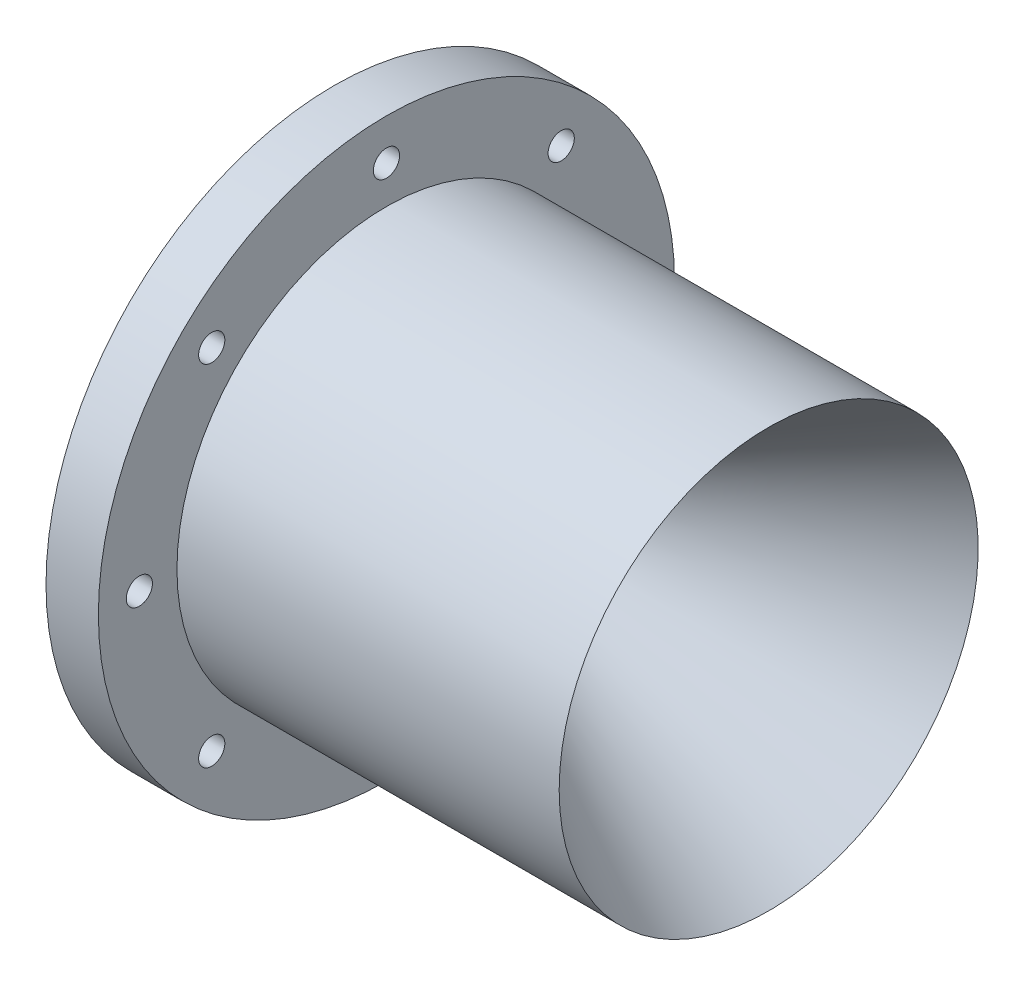
ISO-10303-21;
HEADER;
FILE_DESCRIPTION(('STEP AP214'),'2;1');
FILE_NAME('part.step','',(''),(''),'','','');
FILE_SCHEMA(('AUTOMOTIVE_DESIGN { 1 0 10303 214 1 1 1 1 }'));
ENDSEC;
DATA;
#1=APPLICATION_CONTEXT('core data for automotive mechanical design processes');
#2=APPLICATION_PROTOCOL_DEFINITION('international standard','automotive_design',2000,#1);
#3=PRODUCT_CONTEXT('',#1,'mechanical');
#4=PRODUCT('Part','Part','',(#3));
#5=PRODUCT_RELATED_PRODUCT_CATEGORY('part','',(#4));
#6=PRODUCT_DEFINITION_FORMATION('','',#4);
#7=PRODUCT_DEFINITION_CONTEXT('part definition',#1,'design');
#8=PRODUCT_DEFINITION('design','',#6,#7);
#9=PRODUCT_DEFINITION_SHAPE('','',#8);
#10=(LENGTH_UNIT() NAMED_UNIT(*) SI_UNIT(.MILLI.,.METRE.));
#11=(NAMED_UNIT(*) PLANE_ANGLE_UNIT() SI_UNIT($,.RADIAN.));
#12=(NAMED_UNIT(*) SI_UNIT($,.STERADIAN.) SOLID_ANGLE_UNIT());
#13=UNCERTAINTY_MEASURE_WITH_UNIT(LENGTH_MEASURE(1.E-05),#10,'distance_accuracy_value','');
#14=(GEOMETRIC_REPRESENTATION_CONTEXT(3) GLOBAL_UNCERTAINTY_ASSIGNED_CONTEXT((#13)) GLOBAL_UNIT_ASSIGNED_CONTEXT((#10,
#11,#12)) REPRESENTATION_CONTEXT('',''));
#15=CARTESIAN_POINT('',(0.,0.,0.));
#16=DIRECTION('',(0.,0.,1.));
#17=DIRECTION('',(1.,0.,0.));
#18=AXIS2_PLACEMENT_3D('',#15,#16,#17);
#19=CARTESIAN_POINT('',(0.,0.,0.));
#20=DIRECTION('',(-1.,0.,0.));
#21=DIRECTION('',(0.,0.,1.));
#22=AXIS2_PLACEMENT_3D('',#19,#20,#21);
#23=CYLINDRICAL_SURFACE('',#22,7.9375);
#24=CARTESIAN_POINT('',(0.,0.,0.));
#25=DIRECTION('',(-1.,0.,0.));
#26=DIRECTION('',(0.,0.,1.));
#27=AXIS2_PLACEMENT_3D('',#24,#25,#26);
#28=CIRCLE('',#27,7.9375);
#29=CARTESIAN_POINT('',(0.,0.,7.9375));
#30=VERTEX_POINT('',#29);
#31=EDGE_CURVE('E10',#30,#30,#28,.T.);
#32=ORIENTED_EDGE('',*,*,#31,.F.);
#33=EDGE_LOOP('',(#32));
#34=FACE_BOUND('',#33,.T.);
#35=CARTESIAN_POINT('',(-12.7,0.,0.));
#36=DIRECTION('',(-1.,0.,0.));
#37=DIRECTION('',(0.,0.,1.));
#38=AXIS2_PLACEMENT_3D('',#35,#36,#37);
#39=CIRCLE('',#38,7.9375);
#40=CARTESIAN_POINT('',(-12.7,0.,7.9375));
#41=VERTEX_POINT('',#40);
#42=EDGE_CURVE('E58',#41,#41,#39,.T.);
#43=ORIENTED_EDGE('',*,*,#42,.T.);
#44=EDGE_LOOP('',(#43));
#45=FACE_BOUND('',#44,.T.);
#46=ADVANCED_FACE('F33',(#34,#45),#23,.F.);
#47=CARTESIAN_POINT('',(0.,0.,0.));
#48=DIRECTION('',(1.,0.,0.));
#49=DIRECTION('',(0.,0.,-1.));
#50=AXIS2_PLACEMENT_3D('',#47,#48,#49);
#51=CONICAL_SURFACE('',#50,7.9375,0.534993353531431);
#52=CARTESIAN_POINT('',(72.3241560558228,0.,0.));
#53=DIRECTION('',(-1.,0.,0.));
#54=DIRECTION('',(0.,0.,1.));
#55=AXIS2_PLACEMENT_3D('',#52,#53,#54);
#56=CIRCLE('',#55,50.8);
#57=CARTESIAN_POINT('',(72.3241560558228,0.,50.8));
#58=VERTEX_POINT('',#57);
#59=EDGE_CURVE('E39',#58,#58,#56,.T.);
#60=ORIENTED_EDGE('',*,*,#59,.F.);
#61=EDGE_LOOP('',(#60));
#62=FACE_BOUND('',#61,.T.);
#63=ORIENTED_EDGE('',*,*,#31,.T.);
#64=EDGE_LOOP('',(#63));
#65=FACE_BOUND('',#64,.T.);
#66=ADVANCED_FACE('F151',(#62,#65),#51,.F.);
#67=CARTESIAN_POINT('',(0.,0.,0.));
#68=DIRECTION('',(-1.,0.,0.));
#69=DIRECTION('',(0.,0.,1.));
#70=AXIS2_PLACEMENT_3D('',#67,#68,#69);
#71=CYLINDRICAL_SURFACE('',#70,50.8);
#72=CARTESIAN_POINT('',(-20.3472668619156,0.,0.));
#73=DIRECTION('',(-1.,0.,0.));
#74=DIRECTION('',(0.,0.,1.));
#75=AXIS2_PLACEMENT_3D('',#72,#73,#74);
#76=CIRCLE('',#75,50.8);
#77=CARTESIAN_POINT('',(-20.3472668619156,0.,50.8));
#78=VERTEX_POINT('',#77);
#79=EDGE_CURVE('E43',#78,#78,#76,.T.);
#80=ORIENTED_EDGE('',*,*,#79,.F.);
#81=EDGE_LOOP('',(#80));
#82=FACE_BOUND('',#81,.T.);
#83=ORIENTED_EDGE('',*,*,#59,.T.);
#84=EDGE_LOOP('',(#83));
#85=FACE_BOUND('',#84,.T.);
#86=ADVANCED_FACE('F145',(#82,#85),#71,.T.);
#87=CARTESIAN_POINT('',(-20.3472668619156,69.85,0.));
#88=DIRECTION('',(-1.,0.,0.));
#89=DIRECTION('',(0.,0.,1.));
#90=AXIS2_PLACEMENT_3D('',#87,#88,#89);
#91=PLANE('',#90);
#92=CARTESIAN_POINT('',(-20.3472668619156,59.9186,0.));
#93=DIRECTION('',(-1.,0.,0.));
#94=DIRECTION('',(0.,0.,1.));
#95=AXIS2_PLACEMENT_3D('',#92,#93,#94);
#96=CIRCLE('',#95,3.175);
#97=CARTESIAN_POINT('',(-20.3472668619156,59.9186,3.175));
#98=VERTEX_POINT('',#97);
#99=EDGE_CURVE('E61',#98,#98,#96,.F.);
#100=ORIENTED_EDGE('',*,*,#99,.F.);
#101=EDGE_LOOP('',(#100));
#102=FACE_BOUND('',#101,.T.);
#103=CARTESIAN_POINT('',(-20.3472668619156,42.3688483792054,42.3688483792047));
#104=DIRECTION('',(-1.,0.,0.));
#105=DIRECTION('',(0.,0.,1.));
#106=AXIS2_PLACEMENT_3D('',#103,#104,#105);
#107=CIRCLE('',#106,3.17500000000024);
#108=CARTESIAN_POINT('',(-20.3472668619156,42.3688483792054,45.543848379205));
#109=VERTEX_POINT('',#108);
#110=EDGE_CURVE('E99',#109,#109,#107,.F.);
#111=ORIENTED_EDGE('',*,*,#110,.F.);
#112=EDGE_LOOP('',(#111));
#113=FACE_BOUND('',#112,.T.);
#114=CARTESIAN_POINT('',(-20.3472668619156,1.61747136534687E-12,59.9186000000016));
#115=DIRECTION('',(-1.,0.,0.));
#116=DIRECTION('',(0.,0.,1.));
#117=AXIS2_PLACEMENT_3D('',#114,#115,#116);
#118=CIRCLE('',#117,3.175);
#119=CARTESIAN_POINT('',(-20.3472668619156,1.61747136534687E-12,63.0936000000016));
#120=VERTEX_POINT('',#119);
#121=EDGE_CURVE('E93',#120,#120,#118,.F.);
#122=ORIENTED_EDGE('',*,*,#121,.F.);
#123=EDGE_LOOP('',(#122));
#124=FACE_BOUND('',#123,.T.);
#125=CARTESIAN_POINT('',(-20.3472668619156,-42.3688483792031,42.368848379207));
#126=DIRECTION('',(-1.,0.,0.));
#127=DIRECTION('',(0.,0.,1.));
#128=AXIS2_PLACEMENT_3D('',#125,#126,#127);
#129=CIRCLE('',#128,3.175);
#130=CARTESIAN_POINT('',(-20.3472668619156,-42.3688483792031,45.543848379207));
#131=VERTEX_POINT('',#130);
#132=EDGE_CURVE('E87',#131,#131,#129,.F.);
#133=ORIENTED_EDGE('',*,*,#132,.F.);
#134=EDGE_LOOP('',(#133));
#135=FACE_BOUND('',#134,.T.);
#136=CARTESIAN_POINT('',(-20.3472668619156,-59.9186,3.23494273069374E-12));
#137=DIRECTION('',(-1.,0.,0.));
#138=DIRECTION('',(0.,0.,1.));
#139=AXIS2_PLACEMENT_3D('',#136,#137,#138);
#140=CIRCLE('',#139,3.175);
#141=CARTESIAN_POINT('',(-20.3472668619156,-59.9186,3.17500000000323));
#142=VERTEX_POINT('',#141);
#143=EDGE_CURVE('E81',#142,#142,#140,.F.);
#144=ORIENTED_EDGE('',*,*,#143,.F.);
#145=EDGE_LOOP('',(#144));
#146=FACE_BOUND('',#145,.T.);
#147=CARTESIAN_POINT('',(-20.3472668619156,-42.3688483792054,-42.3688483792015));
#148=DIRECTION('',(-1.,0.,0.));
#149=DIRECTION('',(0.,0.,1.));
#150=AXIS2_PLACEMENT_3D('',#147,#148,#149);
#151=CIRCLE('',#150,3.175);
#152=CARTESIAN_POINT('',(-20.3472668619156,-42.3688483792054,-39.1938483792015));
#153=VERTEX_POINT('',#152);
#154=EDGE_CURVE('E75',#153,#153,#151,.F.);
#155=ORIENTED_EDGE('',*,*,#154,.F.);
#156=EDGE_LOOP('',(#155));
#157=FACE_BOUND('',#156,.T.);
#158=CARTESIAN_POINT('',(-20.3472668619156,-1.62480927751681E-12,-59.9185999999984));
#159=DIRECTION('',(-1.,0.,0.));
#160=DIRECTION('',(0.,0.,1.));
#161=AXIS2_PLACEMENT_3D('',#158,#159,#160);
#162=CIRCLE('',#161,3.175);
#163=CARTESIAN_POINT('',(-20.3472668619156,-1.62480927751681E-12,-56.7435999999984));
#164=VERTEX_POINT('',#163);
#165=EDGE_CURVE('E69',#164,#164,#162,.F.);
#166=ORIENTED_EDGE('',*,*,#165,.F.);
#167=EDGE_LOOP('',(#166));
#168=FACE_BOUND('',#167,.T.);
#169=CARTESIAN_POINT('',(-20.3472668619156,42.3688483792031,-42.3688483792038));
#170=DIRECTION('',(-1.,0.,0.));
#171=DIRECTION('',(0.,0.,1.));
#172=AXIS2_PLACEMENT_3D('',#169,#170,#171);
#173=CIRCLE('',#172,3.175);
#174=CARTESIAN_POINT('',(-20.3472668619156,42.3688483792031,-39.1938483792038));
#175=VERTEX_POINT('',#174);
#176=EDGE_CURVE('E62',#175,#175,#173,.F.);
#177=ORIENTED_EDGE('',*,*,#176,.F.);
#178=EDGE_LOOP('',(#177));
#179=FACE_BOUND('',#178,.T.);
#180=CARTESIAN_POINT('',(-20.3472668619156,0.,0.));
#181=DIRECTION('',(-1.,0.,0.));
#182=DIRECTION('',(0.,0.,1.));
#183=AXIS2_PLACEMENT_3D('',#180,#181,#182);
#184=CIRCLE('',#183,69.85);
#185=CARTESIAN_POINT('',(-20.3472668619156,0.,69.85));
#186=VERTEX_POINT('',#185);
#187=EDGE_CURVE('E47',#186,#186,#184,.T.);
#188=ORIENTED_EDGE('',*,*,#187,.F.);
#189=EDGE_LOOP('',(#188));
#190=FACE_BOUND('',#189,.T.);
#191=ORIENTED_EDGE('',*,*,#79,.T.);
#192=EDGE_LOOP('',(#191));
#193=FACE_BOUND('',#192,.T.);
#194=ADVANCED_FACE('F139',(#102,#113,#124,#135,#146,#157,#168,#179,#190,#193),#91,.F.);
#195=CARTESIAN_POINT('',(0.,0.,0.));
#196=DIRECTION('',(-1.,0.,0.));
#197=DIRECTION('',(0.,0.,1.));
#198=AXIS2_PLACEMENT_3D('',#195,#196,#197);
#199=CYLINDRICAL_SURFACE('',#198,69.85);
#200=CARTESIAN_POINT('',(-33.0472668619156,0.,0.));
#201=DIRECTION('',(-1.,0.,0.));
#202=DIRECTION('',(0.,0.,1.));
#203=AXIS2_PLACEMENT_3D('',#200,#201,#202);
#204=CIRCLE('',#203,69.85);
#205=CARTESIAN_POINT('',(-33.0472668619156,0.,69.85));
#206=VERTEX_POINT('',#205);
#207=EDGE_CURVE('E52',#206,#206,#204,.T.);
#208=ORIENTED_EDGE('',*,*,#207,.F.);
#209=EDGE_LOOP('',(#208));
#210=FACE_BOUND('',#209,.T.);
#211=ORIENTED_EDGE('',*,*,#187,.T.);
#212=EDGE_LOOP('',(#211));
#213=FACE_BOUND('',#212,.T.);
#214=ADVANCED_FACE('F117',(#210,#213),#199,.T.);
#215=CARTESIAN_POINT('',(-33.0472668619156,50.8,0.));
#216=DIRECTION('',(1.,0.,0.));
#217=DIRECTION('',(0.,0.,-1.));
#218=AXIS2_PLACEMENT_3D('',#215,#216,#217);
#219=PLANE('',#218);
#220=CARTESIAN_POINT('',(-33.0472668619156,59.9186,0.));
#221=DIRECTION('',(-1.,0.,0.));
#222=DIRECTION('',(0.,0.,1.));
#223=AXIS2_PLACEMENT_3D('',#220,#221,#222);
#224=CIRCLE('',#223,3.175);
#225=CARTESIAN_POINT('',(-33.0472668619156,59.9186,3.175));
#226=VERTEX_POINT('',#225);
#227=EDGE_CURVE('E102',#226,#226,#224,.T.);
#228=ORIENTED_EDGE('',*,*,#227,.F.);
#229=EDGE_LOOP('',(#228));
#230=FACE_BOUND('',#229,.T.);
#231=CARTESIAN_POINT('',(-33.0472668619156,42.3688483792054,42.3688483792047));
#232=DIRECTION('',(-1.,0.,0.));
#233=DIRECTION('',(0.,0.,1.));
#234=AXIS2_PLACEMENT_3D('',#231,#232,#233);
#235=CIRCLE('',#234,3.17500000000024);
#236=CARTESIAN_POINT('',(-33.0472668619156,42.3688483792054,45.543848379205));
#237=VERTEX_POINT('',#236);
#238=EDGE_CURVE('E96',#237,#237,#235,.T.);
#239=ORIENTED_EDGE('',*,*,#238,.F.);
#240=EDGE_LOOP('',(#239));
#241=FACE_BOUND('',#240,.T.);
#242=CARTESIAN_POINT('',(-33.0472668619156,1.61747136534687E-12,59.9186000000016));
#243=DIRECTION('',(-1.,0.,0.));
#244=DIRECTION('',(0.,0.,1.));
#245=AXIS2_PLACEMENT_3D('',#242,#243,#244);
#246=CIRCLE('',#245,3.175);
#247=CARTESIAN_POINT('',(-33.0472668619156,1.61747136534687E-12,63.0936000000016));
#248=VERTEX_POINT('',#247);
#249=EDGE_CURVE('E90',#248,#248,#246,.T.);
#250=ORIENTED_EDGE('',*,*,#249,.F.);
#251=EDGE_LOOP('',(#250));
#252=FACE_BOUND('',#251,.T.);
#253=CARTESIAN_POINT('',(-33.0472668619156,-42.3688483792031,42.368848379207));
#254=DIRECTION('',(-1.,0.,0.));
#255=DIRECTION('',(0.,0.,1.));
#256=AXIS2_PLACEMENT_3D('',#253,#254,#255);
#257=CIRCLE('',#256,3.175);
#258=CARTESIAN_POINT('',(-33.0472668619156,-42.3688483792031,45.543848379207));
#259=VERTEX_POINT('',#258);
#260=EDGE_CURVE('E84',#259,#259,#257,.T.);
#261=ORIENTED_EDGE('',*,*,#260,.F.);
#262=EDGE_LOOP('',(#261));
#263=FACE_BOUND('',#262,.T.);
#264=CARTESIAN_POINT('',(-33.0472668619156,-59.9186,3.23494273069374E-12));
#265=DIRECTION('',(-1.,0.,0.));
#266=DIRECTION('',(0.,0.,1.));
#267=AXIS2_PLACEMENT_3D('',#264,#265,#266);
#268=CIRCLE('',#267,3.175);
#269=CARTESIAN_POINT('',(-33.0472668619156,-59.9186,3.17500000000323));
#270=VERTEX_POINT('',#269);
#271=EDGE_CURVE('E78',#270,#270,#268,.T.);
#272=ORIENTED_EDGE('',*,*,#271,.F.);
#273=EDGE_LOOP('',(#272));
#274=FACE_BOUND('',#273,.T.);
#275=CARTESIAN_POINT('',(-33.0472668619156,-42.3688483792054,-42.3688483792015));
#276=DIRECTION('',(-1.,0.,0.));
#277=DIRECTION('',(0.,0.,1.));
#278=AXIS2_PLACEMENT_3D('',#275,#276,#277);
#279=CIRCLE('',#278,3.175);
#280=CARTESIAN_POINT('',(-33.0472668619156,-42.3688483792054,-39.1938483792015));
#281=VERTEX_POINT('',#280);
#282=EDGE_CURVE('E72',#281,#281,#279,.T.);
#283=ORIENTED_EDGE('',*,*,#282,.F.);
#284=EDGE_LOOP('',(#283));
#285=FACE_BOUND('',#284,.T.);
#286=CARTESIAN_POINT('',(-33.0472668619156,-1.62480927751681E-12,-59.9185999999984));
#287=DIRECTION('',(-1.,0.,0.));
#288=DIRECTION('',(0.,0.,1.));
#289=AXIS2_PLACEMENT_3D('',#286,#287,#288);
#290=CIRCLE('',#289,3.175);
#291=CARTESIAN_POINT('',(-33.0472668619156,-1.62480927751681E-12,-56.7435999999984));
#292=VERTEX_POINT('',#291);
#293=EDGE_CURVE('E65',#292,#292,#290,.T.);
#294=ORIENTED_EDGE('',*,*,#293,.F.);
#295=EDGE_LOOP('',(#294));
#296=FACE_BOUND('',#295,.T.);
#297=CARTESIAN_POINT('',(-33.0472668619156,42.3688483792031,-42.3688483792038));
#298=DIRECTION('',(-1.,0.,0.));
#299=DIRECTION('',(0.,0.,1.));
#300=AXIS2_PLACEMENT_3D('',#297,#298,#299);
#301=CIRCLE('',#300,3.175);
#302=CARTESIAN_POINT('',(-33.0472668619156,42.3688483792031,-39.1938483792038));
#303=VERTEX_POINT('',#302);
#304=EDGE_CURVE('E66',#303,#303,#301,.T.);
#305=ORIENTED_EDGE('',*,*,#304,.F.);
#306=EDGE_LOOP('',(#305));
#307=FACE_BOUND('',#306,.T.);
#308=CARTESIAN_POINT('',(-33.0472668619156,0.,0.));
#309=DIRECTION('',(-1.,0.,0.));
#310=DIRECTION('',(0.,0.,1.));
#311=AXIS2_PLACEMENT_3D('',#308,#309,#310);
#312=CIRCLE('',#311,41.275);
#313=CARTESIAN_POINT('',(-33.0472668619156,0.,41.275));
#314=VERTEX_POINT('',#313);
#315=EDGE_CURVE('E55',#314,#314,#312,.T.);
#316=ORIENTED_EDGE('',*,*,#315,.F.);
#317=EDGE_LOOP('',(#316));
#318=FACE_BOUND('',#317,.T.);
#319=ORIENTED_EDGE('',*,*,#207,.T.);
#320=EDGE_LOOP('',(#319));
#321=FACE_BOUND('',#320,.T.);
#322=ADVANCED_FACE('F113',(#230,#241,#252,#263,#274,#285,#296,#307,#318,#321),#219,.F.);
#323=CARTESIAN_POINT('',(-33.0472668619156,0.,0.));
#324=DIRECTION('',(-1.,0.,0.));
#325=DIRECTION('',(0.,0.,1.));
#326=AXIS2_PLACEMENT_3D('',#323,#324,#325);
#327=CONICAL_SURFACE('',#326,41.275,1.02280730700641);
#328=ORIENTED_EDGE('',*,*,#42,.F.);
#329=EDGE_LOOP('',(#328));
#330=FACE_BOUND('',#329,.T.);
#331=ORIENTED_EDGE('',*,*,#315,.T.);
#332=EDGE_LOOP('',(#331));
#333=FACE_BOUND('',#332,.T.);
#334=ADVANCED_FACE('F116',(#330,#333),#327,.F.);
#335=CARTESIAN_POINT('',(72.3251560558228,42.3688483792031,-42.3688483792038));
#336=DIRECTION('',(-1.,0.,0.));
#337=DIRECTION('',(0.,0.,1.));
#338=AXIS2_PLACEMENT_3D('',#335,#336,#337);
#339=CYLINDRICAL_SURFACE('',#338,3.175);
#340=ORIENTED_EDGE('',*,*,#304,.T.);
#341=EDGE_LOOP('',(#340));
#342=FACE_BOUND('',#341,.T.);
#343=ORIENTED_EDGE('',*,*,#176,.T.);
#344=EDGE_LOOP('',(#343));
#345=FACE_BOUND('',#344,.T.);
#346=ADVANCED_FACE('F166',(#342,#345),#339,.F.);
#347=CARTESIAN_POINT('',(72.3251560558228,-1.62480927751681E-12,-59.9185999999984));
#348=DIRECTION('',(-1.,0.,0.));
#349=DIRECTION('',(0.,0.,1.));
#350=AXIS2_PLACEMENT_3D('',#347,#348,#349);
#351=CYLINDRICAL_SURFACE('',#350,3.175);
#352=ORIENTED_EDGE('',*,*,#293,.T.);
#353=EDGE_LOOP('',(#352));
#354=FACE_BOUND('',#353,.T.);
#355=ORIENTED_EDGE('',*,*,#165,.T.);
#356=EDGE_LOOP('',(#355));
#357=FACE_BOUND('',#356,.T.);
#358=ADVANCED_FACE('F171',(#354,#357),#351,.F.);
#359=CARTESIAN_POINT('',(72.3251560558228,-42.3688483792054,-42.3688483792015));
#360=DIRECTION('',(-1.,0.,0.));
#361=DIRECTION('',(0.,0.,1.));
#362=AXIS2_PLACEMENT_3D('',#359,#360,#361);
#363=CYLINDRICAL_SURFACE('',#362,3.175);
#364=ORIENTED_EDGE('',*,*,#282,.T.);
#365=EDGE_LOOP('',(#364));
#366=FACE_BOUND('',#365,.T.);
#367=ORIENTED_EDGE('',*,*,#154,.T.);
#368=EDGE_LOOP('',(#367));
#369=FACE_BOUND('',#368,.T.);
#370=ADVANCED_FACE('F177',(#366,#369),#363,.F.);
#371=CARTESIAN_POINT('',(72.3251560558228,-59.9186,3.23494273069374E-12));
#372=DIRECTION('',(-1.,0.,0.));
#373=DIRECTION('',(0.,0.,1.));
#374=AXIS2_PLACEMENT_3D('',#371,#372,#373);
#375=CYLINDRICAL_SURFACE('',#374,3.175);
#376=ORIENTED_EDGE('',*,*,#271,.T.);
#377=EDGE_LOOP('',(#376));
#378=FACE_BOUND('',#377,.T.);
#379=ORIENTED_EDGE('',*,*,#143,.T.);
#380=EDGE_LOOP('',(#379));
#381=FACE_BOUND('',#380,.T.);
#382=ADVANCED_FACE('F181',(#378,#381),#375,.F.);
#383=CARTESIAN_POINT('',(72.3251560558228,-42.3688483792031,42.368848379207));
#384=DIRECTION('',(-1.,0.,0.));
#385=DIRECTION('',(0.,0.,1.));
#386=AXIS2_PLACEMENT_3D('',#383,#384,#385);
#387=CYLINDRICAL_SURFACE('',#386,3.175);
#388=ORIENTED_EDGE('',*,*,#260,.T.);
#389=EDGE_LOOP('',(#388));
#390=FACE_BOUND('',#389,.T.);
#391=ORIENTED_EDGE('',*,*,#132,.T.);
#392=EDGE_LOOP('',(#391));
#393=FACE_BOUND('',#392,.T.);
#394=ADVANCED_FACE('F185',(#390,#393),#387,.F.);
#395=CARTESIAN_POINT('',(72.3251560558228,1.61747136534687E-12,59.9186000000016));
#396=DIRECTION('',(-1.,0.,0.));
#397=DIRECTION('',(0.,0.,1.));
#398=AXIS2_PLACEMENT_3D('',#395,#396,#397);
#399=CYLINDRICAL_SURFACE('',#398,3.175);
#400=ORIENTED_EDGE('',*,*,#249,.T.);
#401=EDGE_LOOP('',(#400));
#402=FACE_BOUND('',#401,.T.);
#403=ORIENTED_EDGE('',*,*,#121,.T.);
#404=EDGE_LOOP('',(#403));
#405=FACE_BOUND('',#404,.T.);
#406=ADVANCED_FACE('F189',(#402,#405),#399,.F.);
#407=CARTESIAN_POINT('',(72.3251560558228,42.3688483792054,42.3688483792047));
#408=DIRECTION('',(-1.,0.,0.));
#409=DIRECTION('',(0.,0.,1.));
#410=AXIS2_PLACEMENT_3D('',#407,#408,#409);
#411=CYLINDRICAL_SURFACE('',#410,3.17500000000024);
#412=ORIENTED_EDGE('',*,*,#238,.T.);
#413=EDGE_LOOP('',(#412));
#414=FACE_BOUND('',#413,.T.);
#415=ORIENTED_EDGE('',*,*,#110,.T.);
#416=EDGE_LOOP('',(#415));
#417=FACE_BOUND('',#416,.T.);
#418=ADVANCED_FACE('F193',(#414,#417),#411,.F.);
#419=CARTESIAN_POINT('',(72.3251560558228,59.9186,0.));
#420=DIRECTION('',(-1.,0.,0.));
#421=DIRECTION('',(0.,0.,1.));
#422=AXIS2_PLACEMENT_3D('',#419,#420,#421);
#423=CYLINDRICAL_SURFACE('',#422,3.175);
#424=ORIENTED_EDGE('',*,*,#227,.T.);
#425=EDGE_LOOP('',(#424));
#426=FACE_BOUND('',#425,.T.);
#427=ORIENTED_EDGE('',*,*,#99,.T.);
#428=EDGE_LOOP('',(#427));
#429=FACE_BOUND('',#428,.T.);
#430=ADVANCED_FACE('F110',(#426,#429),#423,.F.);
#431=CLOSED_SHELL('',(#46,#66,#86,#194,#214,#322,#334,#346,#358,#370,#382,#394,#406,#418,#430));
#432=MANIFOLD_SOLID_BREP('B2',#431);
#433=ADVANCED_BREP_SHAPE_REPRESENTATION('',(#18,#432),#14);
#434=SHAPE_DEFINITION_REPRESENTATION(#9,#433);
ENDSEC;
END-ISO-10303-21;
